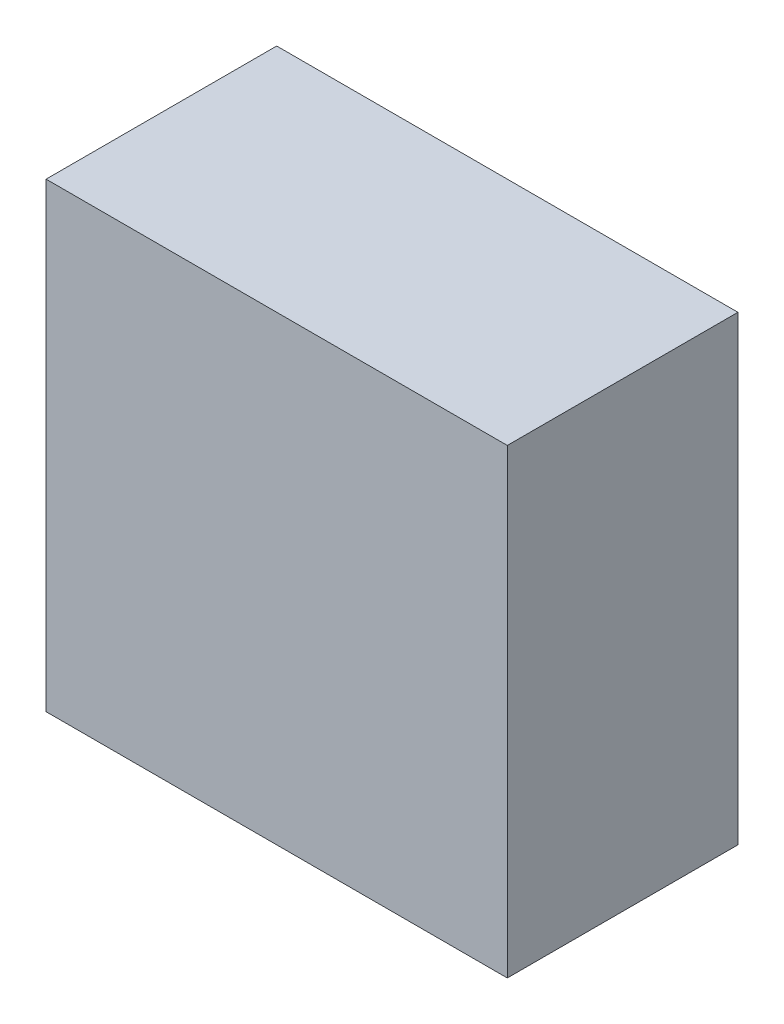
ISO-10303-21;
HEADER;
FILE_DESCRIPTION(('STEP AP214'),'2;1');
FILE_NAME('part.step','',(''),(''),'','','');
FILE_SCHEMA(('AUTOMOTIVE_DESIGN { 1 0 10303 214 1 1 1 1 }'));
ENDSEC;
DATA;
#1=APPLICATION_CONTEXT('core data for automotive mechanical design processes');
#2=APPLICATION_PROTOCOL_DEFINITION('international standard','automotive_design',2000,#1);
#3=PRODUCT_CONTEXT('',#1,'mechanical');
#4=PRODUCT('Part','Part','',(#3));
#5=PRODUCT_RELATED_PRODUCT_CATEGORY('part','',(#4));
#6=PRODUCT_DEFINITION_FORMATION('','',#4);
#7=PRODUCT_DEFINITION_CONTEXT('part definition',#1,'design');
#8=PRODUCT_DEFINITION('design','',#6,#7);
#9=PRODUCT_DEFINITION_SHAPE('','',#8);
#10=(LENGTH_UNIT() NAMED_UNIT(*) SI_UNIT(.MILLI.,.METRE.));
#11=(NAMED_UNIT(*) PLANE_ANGLE_UNIT() SI_UNIT($,.RADIAN.));
#12=(NAMED_UNIT(*) SI_UNIT($,.STERADIAN.) SOLID_ANGLE_UNIT());
#13=UNCERTAINTY_MEASURE_WITH_UNIT(LENGTH_MEASURE(1.E-05),#10,'distance_accuracy_value','');
#14=(GEOMETRIC_REPRESENTATION_CONTEXT(3) GLOBAL_UNCERTAINTY_ASSIGNED_CONTEXT((#13)) GLOBAL_UNIT_ASSIGNED_CONTEXT((#10,
#11,#12)) REPRESENTATION_CONTEXT('',''));
#15=CARTESIAN_POINT('',(0.,0.,0.));
#16=DIRECTION('',(0.,0.,1.));
#17=DIRECTION('',(1.,0.,0.));
#18=AXIS2_PLACEMENT_3D('',#15,#16,#17);
#19=CARTESIAN_POINT('',(20.,-20.,20.));
#20=DIRECTION('',(-1.,0.,0.));
#21=DIRECTION('',(0.,0.,1.));
#22=AXIS2_PLACEMENT_3D('',#19,#20,#21);
#23=PLANE('',#22);
#24=DIRECTION('',(0.,1.,0.));
#25=VECTOR('',#24,1.);
#26=CARTESIAN_POINT('',(20.,-20.,0.));
#27=LINE('',#26,#25);
#28=CARTESIAN_POINT('',(20.,-20.,0.));
#29=VERTEX_POINT('',#28);
#30=CARTESIAN_POINT('',(20.,20.,0.));
#31=VERTEX_POINT('',#30);
#32=EDGE_CURVE('E100',#29,#31,#27,.T.);
#33=ORIENTED_EDGE('',*,*,#32,.T.);
#34=DIRECTION('',(0.,0.,-1.));
#35=VECTOR('',#34,1.);
#36=CARTESIAN_POINT('',(20.,20.,20.));
#37=LINE('',#36,#35);
#38=CARTESIAN_POINT('',(20.,20.,20.));
#39=VERTEX_POINT('',#38);
#40=EDGE_CURVE('E11',#39,#31,#37,.T.);
#41=ORIENTED_EDGE('',*,*,#40,.F.);
#42=DIRECTION('',(0.,1.,0.));
#43=VECTOR('',#42,1.);
#44=CARTESIAN_POINT('',(20.,-20.,20.));
#45=LINE('',#44,#43);
#46=CARTESIAN_POINT('',(20.,-20.,20.));
#47=VERTEX_POINT('',#46);
#48=EDGE_CURVE('E88',#47,#39,#45,.T.);
#49=ORIENTED_EDGE('',*,*,#48,.F.);
#50=DIRECTION('',(0.,0.,-1.));
#51=VECTOR('',#50,1.);
#52=CARTESIAN_POINT('',(20.,-20.,20.));
#53=LINE('',#52,#51);
#54=EDGE_CURVE('E96',#47,#29,#53,.T.);
#55=ORIENTED_EDGE('',*,*,#54,.T.);
#56=EDGE_LOOP('',(#33,#41,#49,#55));
#57=FACE_BOUND('',#56,.T.);
#58=ADVANCED_FACE('F37',(#57),#23,.F.);
#59=CARTESIAN_POINT('',(-20.,20.,20.));
#60=DIRECTION('',(0.,-1.,0.));
#61=DIRECTION('',(0.,0.,-1.));
#62=AXIS2_PLACEMENT_3D('',#59,#60,#61);
#63=PLANE('',#62);
#64=DIRECTION('',(-1.,0.,0.));
#65=VECTOR('',#64,1.);
#66=CARTESIAN_POINT('',(-20.,20.,0.));
#67=LINE('',#66,#65);
#68=CARTESIAN_POINT('',(-20.,20.,0.));
#69=VERTEX_POINT('',#68);
#70=EDGE_CURVE('E92',#31,#69,#67,.T.);
#71=ORIENTED_EDGE('',*,*,#70,.T.);
#72=DIRECTION('',(0.,0.,-1.));
#73=VECTOR('',#72,1.);
#74=CARTESIAN_POINT('',(-20.,20.,20.));
#75=LINE('',#74,#73);
#76=CARTESIAN_POINT('',(-20.,20.,20.));
#77=VERTEX_POINT('',#76);
#78=EDGE_CURVE('E45',#77,#69,#75,.T.);
#79=ORIENTED_EDGE('',*,*,#78,.F.);
#80=DIRECTION('',(-1.,0.,0.));
#81=VECTOR('',#80,1.);
#82=CARTESIAN_POINT('',(-20.,20.,20.));
#83=LINE('',#82,#81);
#84=EDGE_CURVE('E83',#39,#77,#83,.T.);
#85=ORIENTED_EDGE('',*,*,#84,.F.);
#86=ORIENTED_EDGE('',*,*,#40,.T.);
#87=EDGE_LOOP('',(#71,#79,#85,#86));
#88=FACE_BOUND('',#87,.T.);
#89=ADVANCED_FACE('F91',(#88),#63,.F.);
#90=CARTESIAN_POINT('',(-20.,-20.,20.));
#91=DIRECTION('',(1.,0.,0.));
#92=DIRECTION('',(0.,0.,-1.));
#93=AXIS2_PLACEMENT_3D('',#90,#91,#92);
#94=PLANE('',#93);
#95=DIRECTION('',(0.,-1.,0.));
#96=VECTOR('',#95,1.);
#97=CARTESIAN_POINT('',(-20.,-20.,0.));
#98=LINE('',#97,#96);
#99=CARTESIAN_POINT('',(-20.,-20.,0.));
#100=VERTEX_POINT('',#99);
#101=EDGE_CURVE('E70',#69,#100,#98,.T.);
#102=ORIENTED_EDGE('',*,*,#101,.T.);
#103=DIRECTION('',(0.,0.,-1.));
#104=VECTOR('',#103,1.);
#105=CARTESIAN_POINT('',(-20.,-20.,20.));
#106=LINE('',#105,#104);
#107=CARTESIAN_POINT('',(-20.,-20.,20.));
#108=VERTEX_POINT('',#107);
#109=EDGE_CURVE('E93',#108,#100,#106,.T.);
#110=ORIENTED_EDGE('',*,*,#109,.F.);
#111=DIRECTION('',(0.,-1.,0.));
#112=VECTOR('',#111,1.);
#113=CARTESIAN_POINT('',(-20.,-20.,20.));
#114=LINE('',#113,#112);
#115=EDGE_CURVE('E86',#77,#108,#114,.T.);
#116=ORIENTED_EDGE('',*,*,#115,.F.);
#117=ORIENTED_EDGE('',*,*,#78,.T.);
#118=EDGE_LOOP('',(#102,#110,#116,#117));
#119=FACE_BOUND('',#118,.T.);
#120=ADVANCED_FACE('F94',(#119),#94,.F.);
#121=CARTESIAN_POINT('',(-20.,-20.,20.));
#122=DIRECTION('',(0.,1.,0.));
#123=DIRECTION('',(0.,0.,1.));
#124=AXIS2_PLACEMENT_3D('',#121,#122,#123);
#125=PLANE('',#124);
#126=DIRECTION('',(1.,0.,0.));
#127=VECTOR('',#126,1.);
#128=CARTESIAN_POINT('',(-20.,-20.,0.));
#129=LINE('',#128,#127);
#130=EDGE_CURVE('E76',#100,#29,#129,.T.);
#131=ORIENTED_EDGE('',*,*,#130,.T.);
#132=ORIENTED_EDGE('',*,*,#54,.F.);
#133=DIRECTION('',(1.,0.,0.));
#134=VECTOR('',#133,1.);
#135=CARTESIAN_POINT('',(-20.,-20.,20.));
#136=LINE('',#135,#134);
#137=EDGE_CURVE('E53',#108,#47,#136,.T.);
#138=ORIENTED_EDGE('',*,*,#137,.F.);
#139=ORIENTED_EDGE('',*,*,#109,.T.);
#140=EDGE_LOOP('',(#131,#132,#138,#139));
#141=FACE_BOUND('',#140,.T.);
#142=ADVANCED_FACE('F107',(#141),#125,.F.);
#143=CARTESIAN_POINT('',(0.,0.,20.));
#144=DIRECTION('',(0.,0.,-1.));
#145=DIRECTION('',(-1.,0.,0.));
#146=AXIS2_PLACEMENT_3D('',#143,#144,#145);
#147=PLANE('',#146);
#148=ORIENTED_EDGE('',*,*,#48,.T.);
#149=ORIENTED_EDGE('',*,*,#84,.T.);
#150=ORIENTED_EDGE('',*,*,#115,.T.);
#151=ORIENTED_EDGE('',*,*,#137,.T.);
#152=EDGE_LOOP('',(#148,#149,#150,#151));
#153=FACE_BOUND('',#152,.T.);
#154=ADVANCED_FACE('F84',(#153),#147,.F.);
#155=CARTESIAN_POINT('',(0.,0.,0.));
#156=DIRECTION('',(0.,0.,-1.));
#157=DIRECTION('',(-1.,0.,0.));
#158=AXIS2_PLACEMENT_3D('',#155,#156,#157);
#159=PLANE('',#158);
#160=ORIENTED_EDGE('',*,*,#32,.F.);
#161=ORIENTED_EDGE('',*,*,#130,.F.);
#162=ORIENTED_EDGE('',*,*,#101,.F.);
#163=ORIENTED_EDGE('',*,*,#70,.F.);
#164=EDGE_LOOP('',(#160,#161,#162,#163));
#165=FACE_BOUND('',#164,.T.);
#166=ADVANCED_FACE('F110',(#165),#159,.T.);
#167=CLOSED_SHELL('',(#58,#89,#120,#142,#154,#166));
#168=MANIFOLD_SOLID_BREP('B2',#167);
#169=ADVANCED_BREP_SHAPE_REPRESENTATION('',(#18,#168),#14);
#170=SHAPE_DEFINITION_REPRESENTATION(#9,#169);
ENDSEC;
END-ISO-10303-21;
